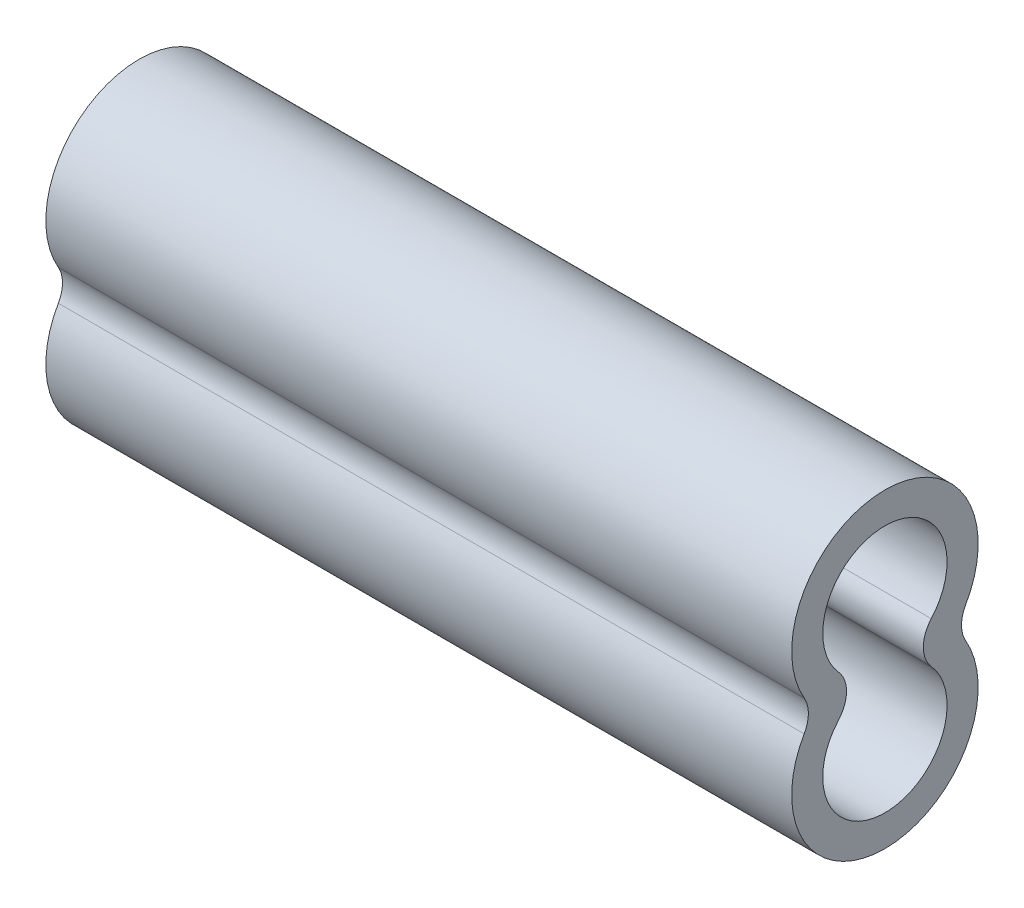
ISO-10303-21;
HEADER;
FILE_DESCRIPTION(('STEP AP214'),'2;1');
FILE_NAME('part.step','',(''),(''),'','','');
FILE_SCHEMA(('AUTOMOTIVE_DESIGN { 1 0 10303 214 1 1 1 1 }'));
ENDSEC;
DATA;
#1=APPLICATION_CONTEXT('core data for automotive mechanical design processes');
#2=APPLICATION_PROTOCOL_DEFINITION('international standard','automotive_design',2000,#1);
#3=PRODUCT_CONTEXT('',#1,'mechanical');
#4=PRODUCT('Part','Part','',(#3));
#5=PRODUCT_RELATED_PRODUCT_CATEGORY('part','',(#4));
#6=PRODUCT_DEFINITION_FORMATION('','',#4);
#7=PRODUCT_DEFINITION_CONTEXT('part definition',#1,'design');
#8=PRODUCT_DEFINITION('design','',#6,#7);
#9=PRODUCT_DEFINITION_SHAPE('','',#8);
#10=(LENGTH_UNIT() NAMED_UNIT(*) SI_UNIT(.MILLI.,.METRE.));
#11=(NAMED_UNIT(*) PLANE_ANGLE_UNIT() SI_UNIT($,.RADIAN.));
#12=(NAMED_UNIT(*) SI_UNIT($,.STERADIAN.) SOLID_ANGLE_UNIT());
#13=UNCERTAINTY_MEASURE_WITH_UNIT(LENGTH_MEASURE(1.E-05),#10,'distance_accuracy_value','');
#14=(GEOMETRIC_REPRESENTATION_CONTEXT(3) GLOBAL_UNCERTAINTY_ASSIGNED_CONTEXT((#13)) GLOBAL_UNIT_ASSIGNED_CONTEXT((#10,
#11,#12)) REPRESENTATION_CONTEXT('',''));
#15=CARTESIAN_POINT('',(0.,0.,0.));
#16=DIRECTION('',(0.,0.,1.));
#17=DIRECTION('',(1.,0.,0.));
#18=AXIS2_PLACEMENT_3D('',#15,#16,#17);
#19=CARTESIAN_POINT('',(9.525,0.,0.0503189986778008));
#20=DIRECTION('',(1.,0.,0.));
#21=DIRECTION('',(0.,0.,-1.));
#22=AXIS2_PLACEMENT_3D('',#19,#20,#21);
#23=PLANE('',#22);
#24=CARTESIAN_POINT('',(9.525,0.79375,0.0503189986778008));
#25=DIRECTION('',(1.,0.,0.));
#26=DIRECTION('',(0.,0.,-1.));
#27=AXIS2_PLACEMENT_3D('',#24,#25,#26);
#28=CIRCLE('',#27,1.190625);
#29=CARTESIAN_POINT('',(9.525,0.1984375,-0.980792497703046));
#30=VERTEX_POINT('',#29);
#31=CARTESIAN_POINT('',(9.525,0.1984375,1.08143049505865));
#32=VERTEX_POINT('',#31);
#33=EDGE_CURVE('E143',#30,#32,#28,.T.);
#34=ORIENTED_EDGE('',*,*,#33,.T.);
#35=CARTESIAN_POINT('',(9.525,0.,1.4251343271856));
#36=DIRECTION('',(1.,0.,0.));
#37=DIRECTION('',(0.,0.,-1.));
#38=AXIS2_PLACEMENT_3D('',#35,#36,#37);
#39=CIRCLE('',#38,0.396875);
#40=CARTESIAN_POINT('',(9.525,-0.1984375,1.08143049505865));
#41=VERTEX_POINT('',#40);
#42=EDGE_CURVE('E11',#32,#41,#39,.F.);
#43=ORIENTED_EDGE('',*,*,#42,.T.);
#44=CARTESIAN_POINT('',(9.525,-0.79375,0.0503189986778008));
#45=DIRECTION('',(1.,0.,0.));
#46=DIRECTION('',(0.,0.,-1.));
#47=AXIS2_PLACEMENT_3D('',#44,#45,#46);
#48=CIRCLE('',#47,1.190625);
#49=CARTESIAN_POINT('',(9.525,-0.1984375,-0.980792497703046));
#50=VERTEX_POINT('',#49);
#51=EDGE_CURVE('E141',#41,#50,#48,.T.);
#52=ORIENTED_EDGE('',*,*,#51,.T.);
#53=CARTESIAN_POINT('',(9.525,0.,-1.32449632983));
#54=DIRECTION('',(1.,0.,0.));
#55=DIRECTION('',(0.,0.,-1.));
#56=AXIS2_PLACEMENT_3D('',#53,#54,#55);
#57=CIRCLE('',#56,0.396875);
#58=EDGE_CURVE('E160',#50,#30,#57,.F.);
#59=ORIENTED_EDGE('',*,*,#58,.T.);
#60=EDGE_LOOP('',(#34,#43,#52,#59));
#61=FACE_BOUND('',#60,.T.);
#62=CARTESIAN_POINT('',(9.525,-0.79375,0.0503189986778008));
#63=DIRECTION('',(1.,0.,0.));
#64=DIRECTION('',(0.,0.,-1.));
#65=AXIS2_PLACEMENT_3D('',#62,#63,#64);
#66=CIRCLE('',#65,0.79375);
#67=CARTESIAN_POINT('',(9.525,-0.264583333333333,0.64194531772462));
#68=VERTEX_POINT('',#67);
#69=CARTESIAN_POINT('',(9.525,-0.264583333333333,-0.541307320369019));
#70=VERTEX_POINT('',#69);
#71=EDGE_CURVE('E110',#68,#70,#66,.T.);
#72=ORIENTED_EDGE('',*,*,#71,.F.);
#73=CARTESIAN_POINT('',(9.525,0.,0.93775847724803));
#74=DIRECTION('',(-1.,0.,0.));
#75=DIRECTION('',(0.,0.,1.));
#76=AXIS2_PLACEMENT_3D('',#73,#74,#75);
#77=CIRCLE('',#76,0.396875);
#78=CARTESIAN_POINT('',(9.525,0.264583333333333,0.64194531772462));
#79=VERTEX_POINT('',#78);
#80=EDGE_CURVE('E100',#79,#68,#77,.T.);
#81=ORIENTED_EDGE('',*,*,#80,.F.);
#82=CARTESIAN_POINT('',(9.525,0.79375,0.0503189986778008));
#83=DIRECTION('',(1.,0.,0.));
#84=DIRECTION('',(0.,0.,-1.));
#85=AXIS2_PLACEMENT_3D('',#82,#83,#84);
#86=CIRCLE('',#85,0.79375);
#87=CARTESIAN_POINT('',(9.525,0.264583333333333,-0.541307320369019));
#88=VERTEX_POINT('',#87);
#89=EDGE_CURVE('E125',#88,#79,#86,.T.);
#90=ORIENTED_EDGE('',*,*,#89,.F.);
#91=CARTESIAN_POINT('',(9.525,0.,-0.837120479892428));
#92=DIRECTION('',(-1.,0.,0.));
#93=DIRECTION('',(0.,0.,-1.));
#94=AXIS2_PLACEMENT_3D('',#91,#92,#93);
#95=CIRCLE('',#94,0.396875);
#96=EDGE_CURVE('E123',#70,#88,#95,.T.);
#97=ORIENTED_EDGE('',*,*,#96,.F.);
#98=EDGE_LOOP('',(#72,#81,#90,#97));
#99=FACE_BOUND('',#98,.T.);
#100=ADVANCED_FACE('F34',(#61,#99),#23,.T.);
#101=CARTESIAN_POINT('',(0.,0.,0.0503189986778008));
#102=DIRECTION('',(1.,0.,0.));
#103=DIRECTION('',(0.,0.,-1.));
#104=AXIS2_PLACEMENT_3D('',#101,#102,#103);
#105=PLANE('',#104);
#106=CARTESIAN_POINT('',(0.,-0.79375,0.0503189986778008));
#107=DIRECTION('',(1.,0.,0.));
#108=DIRECTION('',(0.,0.,-1.));
#109=AXIS2_PLACEMENT_3D('',#106,#107,#108);
#110=CIRCLE('',#109,1.190625);
#111=CARTESIAN_POINT('',(0.,-0.1984375,1.08143049505865));
#112=VERTEX_POINT('',#111);
#113=CARTESIAN_POINT('',(0.,-0.1984375,-0.980792497703046));
#114=VERTEX_POINT('',#113);
#115=EDGE_CURVE('E118',#112,#114,#110,.T.);
#116=ORIENTED_EDGE('',*,*,#115,.F.);
#117=CARTESIAN_POINT('',(0.,0.,1.4251343271856));
#118=DIRECTION('',(1.,0.,0.));
#119=DIRECTION('',(0.,0.,-1.));
#120=AXIS2_PLACEMENT_3D('',#117,#118,#119);
#121=CIRCLE('',#120,0.396875);
#122=CARTESIAN_POINT('',(0.,0.1984375,1.08143049505865));
#123=VERTEX_POINT('',#122);
#124=EDGE_CURVE('E42',#112,#123,#121,.T.);
#125=ORIENTED_EDGE('',*,*,#124,.T.);
#126=CARTESIAN_POINT('',(0.,0.79375,0.0503189986778008));
#127=DIRECTION('',(1.,0.,0.));
#128=DIRECTION('',(0.,0.,-1.));
#129=AXIS2_PLACEMENT_3D('',#126,#127,#128);
#130=CIRCLE('',#129,1.190625);
#131=CARTESIAN_POINT('',(0.,0.1984375,-0.980792497703046));
#132=VERTEX_POINT('',#131);
#133=EDGE_CURVE('E144',#132,#123,#130,.T.);
#134=ORIENTED_EDGE('',*,*,#133,.F.);
#135=CARTESIAN_POINT('',(0.,0.,-1.32449632983));
#136=DIRECTION('',(1.,0.,0.));
#137=DIRECTION('',(0.,0.,-1.));
#138=AXIS2_PLACEMENT_3D('',#135,#136,#137);
#139=CIRCLE('',#138,0.396875);
#140=EDGE_CURVE('E158',#132,#114,#139,.T.);
#141=ORIENTED_EDGE('',*,*,#140,.T.);
#142=EDGE_LOOP('',(#116,#125,#134,#141));
#143=FACE_BOUND('',#142,.T.);
#144=CARTESIAN_POINT('',(0.,0.,0.93775847724803));
#145=DIRECTION('',(-1.,0.,0.));
#146=DIRECTION('',(0.,0.,1.));
#147=AXIS2_PLACEMENT_3D('',#144,#145,#146);
#148=CIRCLE('',#147,0.396875);
#149=CARTESIAN_POINT('',(0.,0.264583333333333,0.64194531772462));
#150=VERTEX_POINT('',#149);
#151=CARTESIAN_POINT('',(0.,-0.264583333333333,0.64194531772462));
#152=VERTEX_POINT('',#151);
#153=EDGE_CURVE('E129',#150,#152,#148,.T.);
#154=ORIENTED_EDGE('',*,*,#153,.T.);
#155=CARTESIAN_POINT('',(0.,-0.79375,0.0503189986778008));
#156=DIRECTION('',(1.,0.,0.));
#157=DIRECTION('',(0.,0.,-1.));
#158=AXIS2_PLACEMENT_3D('',#155,#156,#157);
#159=CIRCLE('',#158,0.79375);
#160=CARTESIAN_POINT('',(0.,-0.264583333333333,-0.541307320369019));
#161=VERTEX_POINT('',#160);
#162=EDGE_CURVE('E117',#152,#161,#159,.T.);
#163=ORIENTED_EDGE('',*,*,#162,.T.);
#164=CARTESIAN_POINT('',(0.,0.,-0.837120479892428));
#165=DIRECTION('',(-1.,0.,0.));
#166=DIRECTION('',(0.,0.,-1.));
#167=AXIS2_PLACEMENT_3D('',#164,#165,#166);
#168=CIRCLE('',#167,0.396875);
#169=CARTESIAN_POINT('',(0.,0.264583333333333,-0.541307320369019));
#170=VERTEX_POINT('',#169);
#171=EDGE_CURVE('E132',#161,#170,#168,.T.);
#172=ORIENTED_EDGE('',*,*,#171,.T.);
#173=CARTESIAN_POINT('',(0.,0.79375,0.0503189986778008));
#174=DIRECTION('',(1.,0.,0.));
#175=DIRECTION('',(0.,0.,-1.));
#176=AXIS2_PLACEMENT_3D('',#173,#174,#175);
#177=CIRCLE('',#176,0.79375);
#178=EDGE_CURVE('E111',#170,#150,#177,.T.);
#179=ORIENTED_EDGE('',*,*,#178,.T.);
#180=EDGE_LOOP('',(#154,#163,#172,#179));
#181=FACE_BOUND('',#180,.T.);
#182=ADVANCED_FACE('F164',(#143,#181),#105,.F.);
#183=CARTESIAN_POINT('',(9.525,-0.79375,0.0503189986778008));
#184=DIRECTION('',(-1.,0.,0.));
#185=DIRECTION('',(0.,0.,1.));
#186=AXIS2_PLACEMENT_3D('',#183,#184,#185);
#187=CYLINDRICAL_SURFACE('',#186,1.190625);
#188=ORIENTED_EDGE('',*,*,#115,.T.);
#189=DIRECTION('',(-1.,0.,0.));
#190=VECTOR('',#189,1.);
#191=CARTESIAN_POINT('',(9.525,-0.1984375,-0.980792497703046));
#192=LINE('',#191,#190);
#193=EDGE_CURVE('E49',#114,#50,#192,.F.);
#194=ORIENTED_EDGE('',*,*,#193,.T.);
#195=ORIENTED_EDGE('',*,*,#51,.F.);
#196=DIRECTION('',(-1.,0.,0.));
#197=VECTOR('',#196,1.);
#198=CARTESIAN_POINT('',(9.525,-0.1984375,1.08143049505865));
#199=LINE('',#198,#197);
#200=EDGE_CURVE('E154',#41,#112,#199,.T.);
#201=ORIENTED_EDGE('',*,*,#200,.T.);
#202=EDGE_LOOP('',(#188,#194,#195,#201));
#203=FACE_BOUND('',#202,.T.);
#204=ADVANCED_FACE('F173',(#203),#187,.T.);
#205=CARTESIAN_POINT('',(9.525,0.79375,0.0503189986778008));
#206=DIRECTION('',(-1.,0.,0.));
#207=DIRECTION('',(0.,0.,1.));
#208=AXIS2_PLACEMENT_3D('',#205,#206,#207);
#209=CYLINDRICAL_SURFACE('',#208,1.190625);
#210=ORIENTED_EDGE('',*,*,#33,.F.);
#211=DIRECTION('',(-1.,0.,0.));
#212=VECTOR('',#211,1.);
#213=CARTESIAN_POINT('',(9.525,0.1984375,-0.980792497703046));
#214=LINE('',#213,#212);
#215=EDGE_CURVE('E151',#30,#132,#214,.T.);
#216=ORIENTED_EDGE('',*,*,#215,.T.);
#217=ORIENTED_EDGE('',*,*,#133,.T.);
#218=DIRECTION('',(-1.,0.,0.));
#219=VECTOR('',#218,1.);
#220=CARTESIAN_POINT('',(9.525,0.1984375,1.08143049505865));
#221=LINE('',#220,#219);
#222=EDGE_CURVE('E146',#123,#32,#221,.F.);
#223=ORIENTED_EDGE('',*,*,#222,.T.);
#224=EDGE_LOOP('',(#210,#216,#217,#223));
#225=FACE_BOUND('',#224,.T.);
#226=ADVANCED_FACE('F171',(#225),#209,.T.);
#227=CARTESIAN_POINT('',(9.525,0.,0.93775847724803));
#228=DIRECTION('',(-1.,0.,0.));
#229=DIRECTION('',(0.,0.,1.));
#230=AXIS2_PLACEMENT_3D('',#227,#228,#229);
#231=CYLINDRICAL_SURFACE('',#230,0.396875);
#232=ORIENTED_EDGE('',*,*,#153,.F.);
#233=DIRECTION('',(-1.,0.,0.));
#234=VECTOR('',#233,1.);
#235=CARTESIAN_POINT('',(9.525,0.264583333333333,0.64194531772462));
#236=LINE('',#235,#234);
#237=EDGE_CURVE('E106',#79,#150,#236,.T.);
#238=ORIENTED_EDGE('',*,*,#237,.F.);
#239=ORIENTED_EDGE('',*,*,#80,.T.);
#240=DIRECTION('',(-1.,0.,0.));
#241=VECTOR('',#240,1.);
#242=CARTESIAN_POINT('',(9.525,-0.264583333333333,0.64194531772462));
#243=LINE('',#242,#241);
#244=EDGE_CURVE('E103',#68,#152,#243,.T.);
#245=ORIENTED_EDGE('',*,*,#244,.T.);
#246=EDGE_LOOP('',(#232,#238,#239,#245));
#247=FACE_BOUND('',#246,.T.);
#248=ADVANCED_FACE('F102',(#247),#231,.T.);
#249=CARTESIAN_POINT('',(9.525,-0.79375,0.0503189986778008));
#250=DIRECTION('',(-1.,0.,0.));
#251=DIRECTION('',(0.,0.,1.));
#252=AXIS2_PLACEMENT_3D('',#249,#250,#251);
#253=CYLINDRICAL_SURFACE('',#252,0.79375);
#254=ORIENTED_EDGE('',*,*,#162,.F.);
#255=ORIENTED_EDGE('',*,*,#244,.F.);
#256=ORIENTED_EDGE('',*,*,#71,.T.);
#257=DIRECTION('',(-1.,0.,0.));
#258=VECTOR('',#257,1.);
#259=CARTESIAN_POINT('',(9.525,-0.264583333333333,-0.541307320369019));
#260=LINE('',#259,#258);
#261=EDGE_CURVE('E119',#70,#161,#260,.T.);
#262=ORIENTED_EDGE('',*,*,#261,.T.);
#263=EDGE_LOOP('',(#254,#255,#256,#262));
#264=FACE_BOUND('',#263,.T.);
#265=ADVANCED_FACE('F114',(#264),#253,.F.);
#266=CARTESIAN_POINT('',(9.525,0.,-0.837120479892428));
#267=DIRECTION('',(-1.,0.,0.));
#268=DIRECTION('',(0.,0.,1.));
#269=AXIS2_PLACEMENT_3D('',#266,#267,#268);
#270=CYLINDRICAL_SURFACE('',#269,0.396875);
#271=ORIENTED_EDGE('',*,*,#171,.F.);
#272=ORIENTED_EDGE('',*,*,#261,.F.);
#273=ORIENTED_EDGE('',*,*,#96,.T.);
#274=DIRECTION('',(-1.,0.,0.));
#275=VECTOR('',#274,1.);
#276=CARTESIAN_POINT('',(9.525,0.264583333333333,-0.541307320369019));
#277=LINE('',#276,#275);
#278=EDGE_CURVE('E138',#88,#170,#277,.T.);
#279=ORIENTED_EDGE('',*,*,#278,.T.);
#280=EDGE_LOOP('',(#271,#272,#273,#279));
#281=FACE_BOUND('',#280,.T.);
#282=ADVANCED_FACE('F183',(#281),#270,.T.);
#283=CARTESIAN_POINT('',(9.525,0.79375,0.0503189986778008));
#284=DIRECTION('',(-1.,0.,0.));
#285=DIRECTION('',(0.,0.,1.));
#286=AXIS2_PLACEMENT_3D('',#283,#284,#285);
#287=CYLINDRICAL_SURFACE('',#286,0.79375);
#288=ORIENTED_EDGE('',*,*,#178,.F.);
#289=ORIENTED_EDGE('',*,*,#278,.F.);
#290=ORIENTED_EDGE('',*,*,#89,.T.);
#291=ORIENTED_EDGE('',*,*,#237,.T.);
#292=EDGE_LOOP('',(#288,#289,#290,#291));
#293=FACE_BOUND('',#292,.T.);
#294=ADVANCED_FACE('F178',(#293),#287,.F.);
#295=CARTESIAN_POINT('',(9.525,0.,-1.32449632983));
#296=DIRECTION('',(1.,0.,0.));
#297=DIRECTION('',(0.,0.,-1.));
#298=AXIS2_PLACEMENT_3D('',#295,#296,#297);
#299=CYLINDRICAL_SURFACE('',#298,0.396875);
#300=ORIENTED_EDGE('',*,*,#58,.F.);
#301=ORIENTED_EDGE('',*,*,#193,.F.);
#302=ORIENTED_EDGE('',*,*,#140,.F.);
#303=ORIENTED_EDGE('',*,*,#215,.F.);
#304=EDGE_LOOP('',(#300,#301,#302,#303));
#305=FACE_BOUND('',#304,.T.);
#306=ADVANCED_FACE('F176',(#305),#299,.F.);
#307=CARTESIAN_POINT('',(9.525,0.,1.4251343271856));
#308=DIRECTION('',(1.,0.,0.));
#309=DIRECTION('',(0.,0.,-1.));
#310=AXIS2_PLACEMENT_3D('',#307,#308,#309);
#311=CYLINDRICAL_SURFACE('',#310,0.396875);
#312=ORIENTED_EDGE('',*,*,#42,.F.);
#313=ORIENTED_EDGE('',*,*,#222,.F.);
#314=ORIENTED_EDGE('',*,*,#124,.F.);
#315=ORIENTED_EDGE('',*,*,#200,.F.);
#316=EDGE_LOOP('',(#312,#313,#314,#315));
#317=FACE_BOUND('',#316,.T.);
#318=ADVANCED_FACE('F36',(#317),#311,.F.);
#319=CLOSED_SHELL('',(#100,#182,#204,#226,#248,#265,#282,#294,#306,#318));
#320=MANIFOLD_SOLID_BREP('B2',#319);
#321=ADVANCED_BREP_SHAPE_REPRESENTATION('',(#18,#320),#14);
#322=SHAPE_DEFINITION_REPRESENTATION(#9,#321);
ENDSEC;
END-ISO-10303-21;
